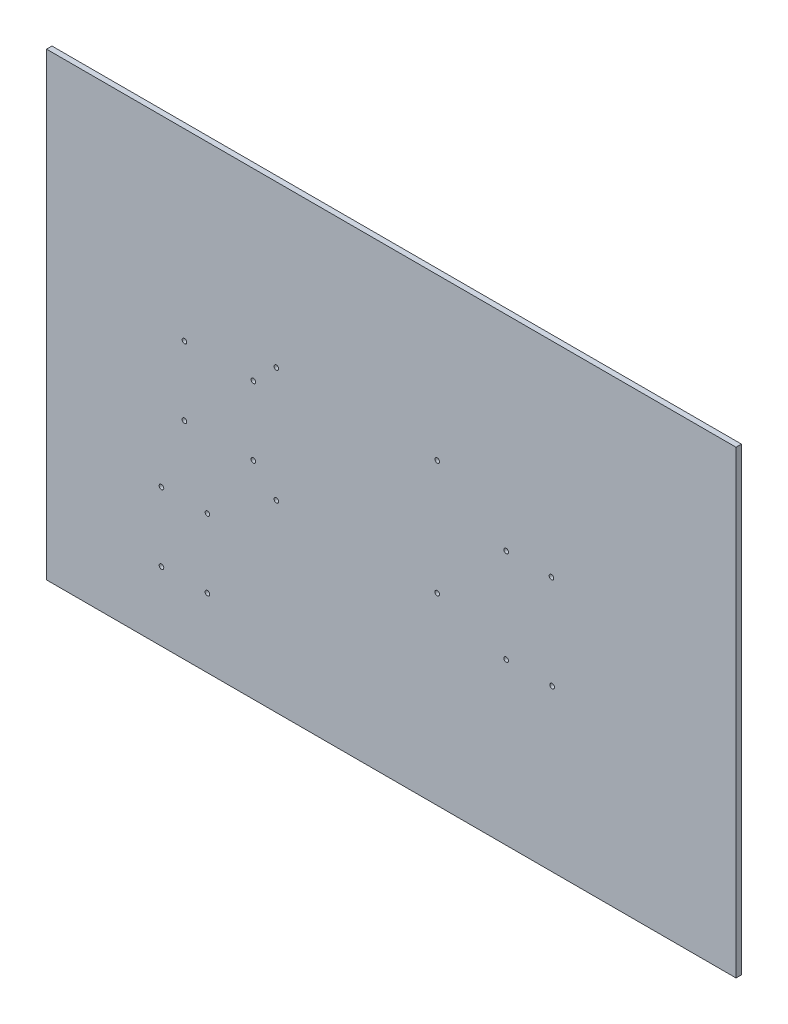
ISO-10303-21;
HEADER;
FILE_DESCRIPTION(('STEP AP214'),'2;1');
FILE_NAME('part.step','',(''),(''),'','','');
FILE_SCHEMA(('AUTOMOTIVE_DESIGN { 1 0 10303 214 1 1 1 1 }'));
ENDSEC;
DATA;
#1=APPLICATION_CONTEXT('core data for automotive mechanical design processes');
#2=APPLICATION_PROTOCOL_DEFINITION('international standard','automotive_design',2000,#1);
#3=PRODUCT_CONTEXT('',#1,'mechanical');
#4=PRODUCT('Part','Part','',(#3));
#5=PRODUCT_RELATED_PRODUCT_CATEGORY('part','',(#4));
#6=PRODUCT_DEFINITION_FORMATION('','',#4);
#7=PRODUCT_DEFINITION_CONTEXT('part definition',#1,'design');
#8=PRODUCT_DEFINITION('design','',#6,#7);
#9=PRODUCT_DEFINITION_SHAPE('','',#8);
#10=(LENGTH_UNIT() NAMED_UNIT(*) SI_UNIT(.MILLI.,.METRE.));
#11=(NAMED_UNIT(*) PLANE_ANGLE_UNIT() SI_UNIT($,.RADIAN.));
#12=(NAMED_UNIT(*) SI_UNIT($,.STERADIAN.) SOLID_ANGLE_UNIT());
#13=UNCERTAINTY_MEASURE_WITH_UNIT(LENGTH_MEASURE(1.E-05),#10,'distance_accuracy_value','');
#14=(GEOMETRIC_REPRESENTATION_CONTEXT(3) GLOBAL_UNCERTAINTY_ASSIGNED_CONTEXT((#13)) GLOBAL_UNIT_ASSIGNED_CONTEXT((#10,
#11,#12)) REPRESENTATION_CONTEXT('',''));
#15=CARTESIAN_POINT('',(0.,0.,0.));
#16=DIRECTION('',(0.,0.,1.));
#17=DIRECTION('',(1.,0.,0.));
#18=AXIS2_PLACEMENT_3D('',#15,#16,#17);
#19=CARTESIAN_POINT('',(0.,0.,6.));
#20=DIRECTION('',(0.,0.,-1.));
#21=DIRECTION('',(-1.,0.,0.));
#22=AXIS2_PLACEMENT_3D('',#19,#20,#21);
#23=PLANE('',#22);
#24=DIRECTION('',(0.,1.,0.));
#25=VECTOR('',#24,1.);
#26=CARTESIAN_POINT('',(381.,-254.,6.));
#27=LINE('',#26,#25);
#28=CARTESIAN_POINT('',(381.,-254.,6.));
#29=VERTEX_POINT('',#28);
#30=CARTESIAN_POINT('',(381.,254.,6.));
#31=VERTEX_POINT('',#30);
#32=EDGE_CURVE('E91',#29,#31,#27,.T.);
#33=ORIENTED_EDGE('',*,*,#32,.T.);
#34=DIRECTION('',(-1.,0.,0.));
#35=VECTOR('',#34,1.);
#36=CARTESIAN_POINT('',(-381.,254.,6.));
#37=LINE('',#36,#35);
#38=CARTESIAN_POINT('',(-381.,254.,6.));
#39=VERTEX_POINT('',#38);
#40=EDGE_CURVE('E86',#31,#39,#37,.T.);
#41=ORIENTED_EDGE('',*,*,#40,.T.);
#42=DIRECTION('',(0.,-1.,0.));
#43=VECTOR('',#42,1.);
#44=CARTESIAN_POINT('',(-381.,-254.,6.));
#45=LINE('',#44,#43);
#46=CARTESIAN_POINT('',(-381.,-254.,6.));
#47=VERTEX_POINT('',#46);
#48=EDGE_CURVE('E89',#39,#47,#45,.T.);
#49=ORIENTED_EDGE('',*,*,#48,.T.);
#50=DIRECTION('',(1.,0.,0.));
#51=VECTOR('',#50,1.);
#52=CARTESIAN_POINT('',(-381.,-254.,6.));
#53=LINE('',#52,#51);
#54=EDGE_CURVE('E56',#47,#29,#53,.T.);
#55=ORIENTED_EDGE('',*,*,#54,.T.);
#56=EDGE_LOOP('',(#33,#41,#49,#55));
#57=FACE_BOUND('',#56,.T.);
#58=CARTESIAN_POINT('',(-228.6,50.8,6.));
#59=DIRECTION('',(0.,0.,1.));
#60=DIRECTION('',(1.,0.,0.));
#61=AXIS2_PLACEMENT_3D('',#58,#59,#60);
#62=CIRCLE('',#61,2.55500000000001);
#63=CARTESIAN_POINT('',(-226.045,50.8,6.));
#64=VERTEX_POINT('',#63);
#65=EDGE_CURVE('E106',#64,#64,#62,.T.);
#66=ORIENTED_EDGE('',*,*,#65,.F.);
#67=EDGE_LOOP('',(#66));
#68=FACE_BOUND('',#67,.T.);
#69=CARTESIAN_POINT('',(-228.6,-25.4,6.));
#70=DIRECTION('',(0.,0.,1.));
#71=DIRECTION('',(1.,0.,0.));
#72=AXIS2_PLACEMENT_3D('',#69,#70,#71);
#73=CIRCLE('',#72,2.55500000000001);
#74=CARTESIAN_POINT('',(-226.045,-25.4,6.));
#75=VERTEX_POINT('',#74);
#76=EDGE_CURVE('E121',#75,#75,#73,.T.);
#77=ORIENTED_EDGE('',*,*,#76,.F.);
#78=EDGE_LOOP('',(#77));
#79=FACE_BOUND('',#78,.T.);
#80=CARTESIAN_POINT('',(-152.4,50.8,6.));
#81=DIRECTION('',(0.,0.,1.));
#82=DIRECTION('',(1.,0.,0.));
#83=AXIS2_PLACEMENT_3D('',#80,#81,#82);
#84=CIRCLE('',#83,2.55500000000001);
#85=CARTESIAN_POINT('',(-149.845,50.8,6.));
#86=VERTEX_POINT('',#85);
#87=EDGE_CURVE('E127',#86,#86,#84,.T.);
#88=ORIENTED_EDGE('',*,*,#87,.F.);
#89=EDGE_LOOP('',(#88));
#90=FACE_BOUND('',#89,.T.);
#91=CARTESIAN_POINT('',(-152.4,-25.3999999999999,6.));
#92=DIRECTION('',(0.,0.,1.));
#93=DIRECTION('',(1.,0.,0.));
#94=AXIS2_PLACEMENT_3D('',#91,#92,#93);
#95=CIRCLE('',#94,2.55500000000001);
#96=CARTESIAN_POINT('',(-149.845,-25.3999999999999,6.));
#97=VERTEX_POINT('',#96);
#98=EDGE_CURVE('E133',#97,#97,#95,.T.);
#99=ORIENTED_EDGE('',*,*,#98,.F.);
#100=EDGE_LOOP('',(#99));
#101=FACE_BOUND('',#100,.T.);
#102=CARTESIAN_POINT('',(-127.,76.2,6.));
#103=DIRECTION('',(0.,0.,1.));
#104=DIRECTION('',(1.,0.,0.));
#105=AXIS2_PLACEMENT_3D('',#102,#103,#104);
#106=CIRCLE('',#105,2.555);
#107=CARTESIAN_POINT('',(-124.445,76.2,6.));
#108=VERTEX_POINT('',#107);
#109=EDGE_CURVE('E139',#108,#108,#106,.T.);
#110=ORIENTED_EDGE('',*,*,#109,.F.);
#111=EDGE_LOOP('',(#110));
#112=FACE_BOUND('',#111,.T.);
#113=CARTESIAN_POINT('',(-127.,-50.8,6.));
#114=DIRECTION('',(0.,0.,1.));
#115=DIRECTION('',(1.,0.,0.));
#116=AXIS2_PLACEMENT_3D('',#113,#114,#115);
#117=CIRCLE('',#116,2.555);
#118=CARTESIAN_POINT('',(-124.445,-50.8,6.));
#119=VERTEX_POINT('',#118);
#120=EDGE_CURVE('E145',#119,#119,#117,.T.);
#121=ORIENTED_EDGE('',*,*,#120,.F.);
#122=EDGE_LOOP('',(#121));
#123=FACE_BOUND('',#122,.T.);
#124=CARTESIAN_POINT('',(50.8000000000002,76.2,6.));
#125=DIRECTION('',(0.,0.,1.));
#126=DIRECTION('',(1.,0.,0.));
#127=AXIS2_PLACEMENT_3D('',#124,#125,#126);
#128=CIRCLE('',#127,2.55500000000001);
#129=CARTESIAN_POINT('',(53.3550000000003,76.2,6.));
#130=VERTEX_POINT('',#129);
#131=EDGE_CURVE('E151',#130,#130,#128,.T.);
#132=ORIENTED_EDGE('',*,*,#131,.F.);
#133=EDGE_LOOP('',(#132));
#134=FACE_BOUND('',#133,.T.);
#135=CARTESIAN_POINT('',(50.8000000000002,-50.8,6.));
#136=DIRECTION('',(0.,0.,1.));
#137=DIRECTION('',(1.,0.,0.));
#138=AXIS2_PLACEMENT_3D('',#135,#136,#137);
#139=CIRCLE('',#138,2.555);
#140=CARTESIAN_POINT('',(53.3550000000002,-50.8,6.));
#141=VERTEX_POINT('',#140);
#142=EDGE_CURVE('E157',#141,#141,#139,.T.);
#143=ORIENTED_EDGE('',*,*,#142,.F.);
#144=EDGE_LOOP('',(#143));
#145=FACE_BOUND('',#144,.T.);
#146=CARTESIAN_POINT('',(-203.2,-177.8,6.));
#147=DIRECTION('',(0.,0.,1.));
#148=DIRECTION('',(1.,0.,0.));
#149=AXIS2_PLACEMENT_3D('',#146,#147,#148);
#150=CIRCLE('',#149,2.55500000000001);
#151=CARTESIAN_POINT('',(-200.645,-177.8,6.));
#152=VERTEX_POINT('',#151);
#153=EDGE_CURVE('E163',#152,#152,#150,.T.);
#154=ORIENTED_EDGE('',*,*,#153,.F.);
#155=EDGE_LOOP('',(#154));
#156=FACE_BOUND('',#155,.T.);
#157=CARTESIAN_POINT('',(-254.,-101.6,6.));
#158=DIRECTION('',(0.,0.,1.));
#159=DIRECTION('',(1.,0.,0.));
#160=AXIS2_PLACEMENT_3D('',#157,#158,#159);
#161=CIRCLE('',#160,2.55499999999998);
#162=CARTESIAN_POINT('',(-251.445,-101.6,6.));
#163=VERTEX_POINT('',#162);
#164=EDGE_CURVE('E169',#163,#163,#161,.T.);
#165=ORIENTED_EDGE('',*,*,#164,.F.);
#166=EDGE_LOOP('',(#165));
#167=FACE_BOUND('',#166,.T.);
#168=CARTESIAN_POINT('',(-254.,-177.8,6.));
#169=DIRECTION('',(0.,0.,1.));
#170=DIRECTION('',(1.,0.,0.));
#171=AXIS2_PLACEMENT_3D('',#168,#169,#170);
#172=CIRCLE('',#171,2.55499999999999);
#173=CARTESIAN_POINT('',(-251.445,-177.8,6.));
#174=VERTEX_POINT('',#173);
#175=EDGE_CURVE('E175',#174,#174,#172,.T.);
#176=ORIENTED_EDGE('',*,*,#175,.F.);
#177=EDGE_LOOP('',(#176));
#178=FACE_BOUND('',#177,.T.);
#179=CARTESIAN_POINT('',(-203.2,-101.6,6.));
#180=DIRECTION('',(0.,0.,1.));
#181=DIRECTION('',(1.,0.,0.));
#182=AXIS2_PLACEMENT_3D('',#179,#180,#181);
#183=CIRCLE('',#182,2.55500000000001);
#184=CARTESIAN_POINT('',(-200.645,-101.6,6.));
#185=VERTEX_POINT('',#184);
#186=EDGE_CURVE('E181',#185,#185,#183,.T.);
#187=ORIENTED_EDGE('',*,*,#186,.F.);
#188=EDGE_LOOP('',(#187));
#189=FACE_BOUND('',#188,.T.);
#190=CARTESIAN_POINT('',(127.,27.7,6.));
#191=DIRECTION('',(0.,0.,1.));
#192=DIRECTION('',(1.,0.,0.));
#193=AXIS2_PLACEMENT_3D('',#190,#191,#192);
#194=CIRCLE('',#193,2.55500000000001);
#195=CARTESIAN_POINT('',(129.555,27.7,6.));
#196=VERTEX_POINT('',#195);
#197=EDGE_CURVE('E187',#196,#196,#194,.T.);
#198=ORIENTED_EDGE('',*,*,#197,.F.);
#199=EDGE_LOOP('',(#198));
#200=FACE_BOUND('',#199,.T.);
#201=CARTESIAN_POINT('',(177.,27.6969200698462,6.));
#202=DIRECTION('',(0.,0.,1.));
#203=DIRECTION('',(1.,0.,0.));
#204=AXIS2_PLACEMENT_3D('',#201,#202,#203);
#205=CIRCLE('',#204,2.55500000000001);
#206=CARTESIAN_POINT('',(179.555,27.6969200698462,6.));
#207=VERTEX_POINT('',#206);
#208=EDGE_CURVE('E193',#207,#207,#205,.T.);
#209=ORIENTED_EDGE('',*,*,#208,.F.);
#210=EDGE_LOOP('',(#209));
#211=FACE_BOUND('',#210,.T.);
#212=CARTESIAN_POINT('',(177.8,-76.2,6.));
#213=DIRECTION('',(0.,0.,1.));
#214=DIRECTION('',(1.,0.,0.));
#215=AXIS2_PLACEMENT_3D('',#212,#213,#214);
#216=CIRCLE('',#215,2.55500000000001);
#217=CARTESIAN_POINT('',(180.355,-76.2,6.));
#218=VERTEX_POINT('',#217);
#219=EDGE_CURVE('E199',#218,#218,#216,.T.);
#220=ORIENTED_EDGE('',*,*,#219,.F.);
#221=EDGE_LOOP('',(#220));
#222=FACE_BOUND('',#221,.T.);
#223=CARTESIAN_POINT('',(127.,-76.2,6.));
#224=DIRECTION('',(0.,0.,1.));
#225=DIRECTION('',(1.,0.,0.));
#226=AXIS2_PLACEMENT_3D('',#223,#224,#225);
#227=CIRCLE('',#226,2.55500000000001);
#228=CARTESIAN_POINT('',(129.555,-76.2,6.));
#229=VERTEX_POINT('',#228);
#230=EDGE_CURVE('E205',#229,#229,#227,.T.);
#231=ORIENTED_EDGE('',*,*,#230,.F.);
#232=EDGE_LOOP('',(#231));
#233=FACE_BOUND('',#232,.T.);
#234=ADVANCED_FACE('F39',(#57,#68,#79,#90,#101,#112,#123,#134,#145,#156,#167,#178,#189,#200,
#211,#222,#233),#23,.F.);
#235=CARTESIAN_POINT('',(0.,0.,0.));
#236=DIRECTION('',(0.,0.,-1.));
#237=DIRECTION('',(-1.,0.,0.));
#238=AXIS2_PLACEMENT_3D('',#235,#236,#237);
#239=PLANE('',#238);
#240=CARTESIAN_POINT('',(177.8,-76.2,0.));
#241=DIRECTION('',(0.,0.,1.));
#242=DIRECTION('',(1.,0.,0.));
#243=AXIS2_PLACEMENT_3D('',#240,#241,#242);
#244=CIRCLE('',#243,2.55500000000001);
#245=CARTESIAN_POINT('',(180.355,-76.2,0.));
#246=VERTEX_POINT('',#245);
#247=EDGE_CURVE('E202',#246,#246,#244,.T.);
#248=ORIENTED_EDGE('',*,*,#247,.T.);
#249=EDGE_LOOP('',(#248));
#250=FACE_BOUND('',#249,.T.);
#251=CARTESIAN_POINT('',(127.,27.7,0.));
#252=DIRECTION('',(0.,0.,1.));
#253=DIRECTION('',(1.,0.,0.));
#254=AXIS2_PLACEMENT_3D('',#251,#252,#253);
#255=CIRCLE('',#254,2.55500000000001);
#256=CARTESIAN_POINT('',(129.555,27.7,0.));
#257=VERTEX_POINT('',#256);
#258=EDGE_CURVE('E190',#257,#257,#255,.T.);
#259=ORIENTED_EDGE('',*,*,#258,.T.);
#260=EDGE_LOOP('',(#259));
#261=FACE_BOUND('',#260,.T.);
#262=CARTESIAN_POINT('',(-254.,-177.8,0.));
#263=DIRECTION('',(0.,0.,1.));
#264=DIRECTION('',(1.,0.,0.));
#265=AXIS2_PLACEMENT_3D('',#262,#263,#264);
#266=CIRCLE('',#265,2.55499999999999);
#267=CARTESIAN_POINT('',(-251.445,-177.8,0.));
#268=VERTEX_POINT('',#267);
#269=EDGE_CURVE('E178',#268,#268,#266,.T.);
#270=ORIENTED_EDGE('',*,*,#269,.T.);
#271=EDGE_LOOP('',(#270));
#272=FACE_BOUND('',#271,.T.);
#273=CARTESIAN_POINT('',(-203.2,-177.8,0.));
#274=DIRECTION('',(0.,0.,1.));
#275=DIRECTION('',(1.,0.,0.));
#276=AXIS2_PLACEMENT_3D('',#273,#274,#275);
#277=CIRCLE('',#276,2.55500000000001);
#278=CARTESIAN_POINT('',(-200.645,-177.8,0.));
#279=VERTEX_POINT('',#278);
#280=EDGE_CURVE('E166',#279,#279,#277,.T.);
#281=ORIENTED_EDGE('',*,*,#280,.T.);
#282=EDGE_LOOP('',(#281));
#283=FACE_BOUND('',#282,.T.);
#284=CARTESIAN_POINT('',(50.8000000000002,76.2,0.));
#285=DIRECTION('',(0.,0.,1.));
#286=DIRECTION('',(1.,0.,0.));
#287=AXIS2_PLACEMENT_3D('',#284,#285,#286);
#288=CIRCLE('',#287,2.55500000000001);
#289=CARTESIAN_POINT('',(53.3550000000003,76.2,0.));
#290=VERTEX_POINT('',#289);
#291=EDGE_CURVE('E154',#290,#290,#288,.T.);
#292=ORIENTED_EDGE('',*,*,#291,.T.);
#293=EDGE_LOOP('',(#292));
#294=FACE_BOUND('',#293,.T.);
#295=CARTESIAN_POINT('',(-127.,76.2,0.));
#296=DIRECTION('',(0.,0.,1.));
#297=DIRECTION('',(1.,0.,0.));
#298=AXIS2_PLACEMENT_3D('',#295,#296,#297);
#299=CIRCLE('',#298,2.555);
#300=CARTESIAN_POINT('',(-124.445,76.2,0.));
#301=VERTEX_POINT('',#300);
#302=EDGE_CURVE('E142',#301,#301,#299,.T.);
#303=ORIENTED_EDGE('',*,*,#302,.T.);
#304=EDGE_LOOP('',(#303));
#305=FACE_BOUND('',#304,.T.);
#306=CARTESIAN_POINT('',(-152.4,50.8,0.));
#307=DIRECTION('',(0.,0.,1.));
#308=DIRECTION('',(1.,0.,0.));
#309=AXIS2_PLACEMENT_3D('',#306,#307,#308);
#310=CIRCLE('',#309,2.55500000000001);
#311=CARTESIAN_POINT('',(-149.845,50.8,0.));
#312=VERTEX_POINT('',#311);
#313=EDGE_CURVE('E130',#312,#312,#310,.T.);
#314=ORIENTED_EDGE('',*,*,#313,.T.);
#315=EDGE_LOOP('',(#314));
#316=FACE_BOUND('',#315,.T.);
#317=CARTESIAN_POINT('',(-228.6,50.8,0.));
#318=DIRECTION('',(0.,0.,1.));
#319=DIRECTION('',(1.,0.,0.));
#320=AXIS2_PLACEMENT_3D('',#317,#318,#319);
#321=CIRCLE('',#320,2.55500000000001);
#322=CARTESIAN_POINT('',(-226.045,50.8,0.));
#323=VERTEX_POINT('',#322);
#324=EDGE_CURVE('E118',#323,#323,#321,.T.);
#325=ORIENTED_EDGE('',*,*,#324,.T.);
#326=EDGE_LOOP('',(#325));
#327=FACE_BOUND('',#326,.T.);
#328=DIRECTION('',(0.,1.,0.));
#329=VECTOR('',#328,1.);
#330=CARTESIAN_POINT('',(381.,-254.,0.));
#331=LINE('',#330,#329);
#332=CARTESIAN_POINT('',(381.,-254.,0.));
#333=VERTEX_POINT('',#332);
#334=CARTESIAN_POINT('',(381.,254.,0.));
#335=VERTEX_POINT('',#334);
#336=EDGE_CURVE('E103',#333,#335,#331,.T.);
#337=ORIENTED_EDGE('',*,*,#336,.F.);
#338=DIRECTION('',(1.,0.,0.));
#339=VECTOR('',#338,1.);
#340=CARTESIAN_POINT('',(-381.,-254.,0.));
#341=LINE('',#340,#339);
#342=CARTESIAN_POINT('',(-381.,-254.,0.));
#343=VERTEX_POINT('',#342);
#344=EDGE_CURVE('E79',#343,#333,#341,.T.);
#345=ORIENTED_EDGE('',*,*,#344,.F.);
#346=DIRECTION('',(0.,-1.,0.));
#347=VECTOR('',#346,1.);
#348=CARTESIAN_POINT('',(-381.,-254.,0.));
#349=LINE('',#348,#347);
#350=CARTESIAN_POINT('',(-381.,254.,0.));
#351=VERTEX_POINT('',#350);
#352=EDGE_CURVE('E73',#351,#343,#349,.T.);
#353=ORIENTED_EDGE('',*,*,#352,.F.);
#354=DIRECTION('',(-1.,0.,0.));
#355=VECTOR('',#354,1.);
#356=CARTESIAN_POINT('',(-381.,254.,0.));
#357=LINE('',#356,#355);
#358=EDGE_CURVE('E95',#335,#351,#357,.T.);
#359=ORIENTED_EDGE('',*,*,#358,.F.);
#360=EDGE_LOOP('',(#337,#345,#353,#359));
#361=FACE_BOUND('',#360,.T.);
#362=CARTESIAN_POINT('',(-228.6,-25.4,0.));
#363=DIRECTION('',(0.,0.,1.));
#364=DIRECTION('',(1.,0.,0.));
#365=AXIS2_PLACEMENT_3D('',#362,#363,#364);
#366=CIRCLE('',#365,2.55500000000001);
#367=CARTESIAN_POINT('',(-226.045,-25.4,0.));
#368=VERTEX_POINT('',#367);
#369=EDGE_CURVE('E124',#368,#368,#366,.T.);
#370=ORIENTED_EDGE('',*,*,#369,.T.);
#371=EDGE_LOOP('',(#370));
#372=FACE_BOUND('',#371,.T.);
#373=CARTESIAN_POINT('',(-152.4,-25.3999999999999,0.));
#374=DIRECTION('',(0.,0.,1.));
#375=DIRECTION('',(1.,0.,0.));
#376=AXIS2_PLACEMENT_3D('',#373,#374,#375);
#377=CIRCLE('',#376,2.55500000000001);
#378=CARTESIAN_POINT('',(-149.845,-25.3999999999999,0.));
#379=VERTEX_POINT('',#378);
#380=EDGE_CURVE('E136',#379,#379,#377,.T.);
#381=ORIENTED_EDGE('',*,*,#380,.T.);
#382=EDGE_LOOP('',(#381));
#383=FACE_BOUND('',#382,.T.);
#384=CARTESIAN_POINT('',(-127.,-50.8,0.));
#385=DIRECTION('',(0.,0.,1.));
#386=DIRECTION('',(1.,0.,0.));
#387=AXIS2_PLACEMENT_3D('',#384,#385,#386);
#388=CIRCLE('',#387,2.555);
#389=CARTESIAN_POINT('',(-124.445,-50.8,0.));
#390=VERTEX_POINT('',#389);
#391=EDGE_CURVE('E148',#390,#390,#388,.T.);
#392=ORIENTED_EDGE('',*,*,#391,.T.);
#393=EDGE_LOOP('',(#392));
#394=FACE_BOUND('',#393,.T.);
#395=CARTESIAN_POINT('',(50.8000000000002,-50.8,0.));
#396=DIRECTION('',(0.,0.,1.));
#397=DIRECTION('',(1.,0.,0.));
#398=AXIS2_PLACEMENT_3D('',#395,#396,#397);
#399=CIRCLE('',#398,2.555);
#400=CARTESIAN_POINT('',(53.3550000000002,-50.8,0.));
#401=VERTEX_POINT('',#400);
#402=EDGE_CURVE('E160',#401,#401,#399,.T.);
#403=ORIENTED_EDGE('',*,*,#402,.T.);
#404=EDGE_LOOP('',(#403));
#405=FACE_BOUND('',#404,.T.);
#406=CARTESIAN_POINT('',(-254.,-101.6,0.));
#407=DIRECTION('',(0.,0.,1.));
#408=DIRECTION('',(1.,0.,0.));
#409=AXIS2_PLACEMENT_3D('',#406,#407,#408);
#410=CIRCLE('',#409,2.55499999999998);
#411=CARTESIAN_POINT('',(-251.445,-101.6,0.));
#412=VERTEX_POINT('',#411);
#413=EDGE_CURVE('E172',#412,#412,#410,.T.);
#414=ORIENTED_EDGE('',*,*,#413,.T.);
#415=EDGE_LOOP('',(#414));
#416=FACE_BOUND('',#415,.T.);
#417=CARTESIAN_POINT('',(-203.2,-101.6,0.));
#418=DIRECTION('',(0.,0.,1.));
#419=DIRECTION('',(1.,0.,0.));
#420=AXIS2_PLACEMENT_3D('',#417,#418,#419);
#421=CIRCLE('',#420,2.55500000000001);
#422=CARTESIAN_POINT('',(-200.645,-101.6,0.));
#423=VERTEX_POINT('',#422);
#424=EDGE_CURVE('E184',#423,#423,#421,.T.);
#425=ORIENTED_EDGE('',*,*,#424,.T.);
#426=EDGE_LOOP('',(#425));
#427=FACE_BOUND('',#426,.T.);
#428=CARTESIAN_POINT('',(177.,27.6969200698462,0.));
#429=DIRECTION('',(0.,0.,1.));
#430=DIRECTION('',(1.,0.,0.));
#431=AXIS2_PLACEMENT_3D('',#428,#429,#430);
#432=CIRCLE('',#431,2.55500000000001);
#433=CARTESIAN_POINT('',(179.555,27.6969200698462,0.));
#434=VERTEX_POINT('',#433);
#435=EDGE_CURVE('E196',#434,#434,#432,.T.);
#436=ORIENTED_EDGE('',*,*,#435,.T.);
#437=EDGE_LOOP('',(#436));
#438=FACE_BOUND('',#437,.T.);
#439=CARTESIAN_POINT('',(127.,-76.2,0.));
#440=DIRECTION('',(0.,0.,1.));
#441=DIRECTION('',(1.,0.,0.));
#442=AXIS2_PLACEMENT_3D('',#439,#440,#441);
#443=CIRCLE('',#442,2.55500000000001);
#444=CARTESIAN_POINT('',(129.555,-76.2,0.));
#445=VERTEX_POINT('',#444);
#446=EDGE_CURVE('E208',#445,#445,#443,.T.);
#447=ORIENTED_EDGE('',*,*,#446,.T.);
#448=EDGE_LOOP('',(#447));
#449=FACE_BOUND('',#448,.T.);
#450=ADVANCED_FACE('F114',(#250,#261,#272,#283,#294,#305,#316,#327,#361,#372,#383,#394,#405,
#416,#427,#438,#449),#239,.T.);
#451=CARTESIAN_POINT('',(381.,-254.,6.));
#452=DIRECTION('',(-1.,0.,0.));
#453=DIRECTION('',(0.,0.,1.));
#454=AXIS2_PLACEMENT_3D('',#451,#452,#453);
#455=PLANE('',#454);
#456=ORIENTED_EDGE('',*,*,#336,.T.);
#457=DIRECTION('',(0.,0.,-1.));
#458=VECTOR('',#457,1.);
#459=CARTESIAN_POINT('',(381.,254.,6.));
#460=LINE('',#459,#458);
#461=EDGE_CURVE('E11',#31,#335,#460,.T.);
#462=ORIENTED_EDGE('',*,*,#461,.F.);
#463=ORIENTED_EDGE('',*,*,#32,.F.);
#464=DIRECTION('',(0.,0.,-1.));
#465=VECTOR('',#464,1.);
#466=CARTESIAN_POINT('',(381.,-254.,6.));
#467=LINE('',#466,#465);
#468=EDGE_CURVE('E99',#29,#333,#467,.T.);
#469=ORIENTED_EDGE('',*,*,#468,.T.);
#470=EDGE_LOOP('',(#456,#462,#463,#469));
#471=FACE_BOUND('',#470,.T.);
#472=ADVANCED_FACE('F41',(#471),#455,.F.);
#473=CARTESIAN_POINT('',(-381.,254.,6.));
#474=DIRECTION('',(0.,-1.,0.));
#475=DIRECTION('',(0.,0.,-1.));
#476=AXIS2_PLACEMENT_3D('',#473,#474,#475);
#477=PLANE('',#476);
#478=ORIENTED_EDGE('',*,*,#358,.T.);
#479=DIRECTION('',(0.,0.,-1.));
#480=VECTOR('',#479,1.);
#481=CARTESIAN_POINT('',(-381.,254.,6.));
#482=LINE('',#481,#480);
#483=EDGE_CURVE('E48',#39,#351,#482,.T.);
#484=ORIENTED_EDGE('',*,*,#483,.F.);
#485=ORIENTED_EDGE('',*,*,#40,.F.);
#486=ORIENTED_EDGE('',*,*,#461,.T.);
#487=EDGE_LOOP('',(#478,#484,#485,#486));
#488=FACE_BOUND('',#487,.T.);
#489=ADVANCED_FACE('F94',(#488),#477,.F.);
#490=CARTESIAN_POINT('',(-381.,-254.,6.));
#491=DIRECTION('',(1.,0.,0.));
#492=DIRECTION('',(0.,0.,-1.));
#493=AXIS2_PLACEMENT_3D('',#490,#491,#492);
#494=PLANE('',#493);
#495=ORIENTED_EDGE('',*,*,#352,.T.);
#496=DIRECTION('',(0.,0.,-1.));
#497=VECTOR('',#496,1.);
#498=CARTESIAN_POINT('',(-381.,-254.,6.));
#499=LINE('',#498,#497);
#500=EDGE_CURVE('E96',#47,#343,#499,.T.);
#501=ORIENTED_EDGE('',*,*,#500,.F.);
#502=ORIENTED_EDGE('',*,*,#48,.F.);
#503=ORIENTED_EDGE('',*,*,#483,.T.);
#504=EDGE_LOOP('',(#495,#501,#502,#503));
#505=FACE_BOUND('',#504,.T.);
#506=ADVANCED_FACE('F97',(#505),#494,.F.);
#507=CARTESIAN_POINT('',(-381.,-254.,6.));
#508=DIRECTION('',(0.,1.,0.));
#509=DIRECTION('',(0.,0.,1.));
#510=AXIS2_PLACEMENT_3D('',#507,#508,#509);
#511=PLANE('',#510);
#512=ORIENTED_EDGE('',*,*,#344,.T.);
#513=ORIENTED_EDGE('',*,*,#468,.F.);
#514=ORIENTED_EDGE('',*,*,#54,.F.);
#515=ORIENTED_EDGE('',*,*,#500,.T.);
#516=EDGE_LOOP('',(#512,#513,#514,#515));
#517=FACE_BOUND('',#516,.T.);
#518=ADVANCED_FACE('F111',(#517),#511,.F.);
#519=CARTESIAN_POINT('',(-228.6,50.8,6.));
#520=DIRECTION('',(0.,0.,-1.));
#521=DIRECTION('',(-1.,0.,0.));
#522=AXIS2_PLACEMENT_3D('',#519,#520,#521);
#523=CYLINDRICAL_SURFACE('',#522,2.55500000000001);
#524=ORIENTED_EDGE('',*,*,#65,.T.);
#525=EDGE_LOOP('',(#524));
#526=FACE_BOUND('',#525,.T.);
#527=ORIENTED_EDGE('',*,*,#324,.F.);
#528=EDGE_LOOP('',(#527));
#529=FACE_BOUND('',#528,.T.);
#530=ADVANCED_FACE('F225',(#526,#529),#523,.F.);
#531=CARTESIAN_POINT('',(-228.6,-25.4,6.));
#532=DIRECTION('',(0.,0.,-1.));
#533=DIRECTION('',(-1.,0.,0.));
#534=AXIS2_PLACEMENT_3D('',#531,#532,#533);
#535=CYLINDRICAL_SURFACE('',#534,2.55500000000001);
#536=ORIENTED_EDGE('',*,*,#76,.T.);
#537=EDGE_LOOP('',(#536));
#538=FACE_BOUND('',#537,.T.);
#539=ORIENTED_EDGE('',*,*,#369,.F.);
#540=EDGE_LOOP('',(#539));
#541=FACE_BOUND('',#540,.T.);
#542=ADVANCED_FACE('F270',(#538,#541),#535,.F.);
#543=CARTESIAN_POINT('',(-152.4,50.8,6.));
#544=DIRECTION('',(0.,0.,-1.));
#545=DIRECTION('',(-1.,0.,0.));
#546=AXIS2_PLACEMENT_3D('',#543,#544,#545);
#547=CYLINDRICAL_SURFACE('',#546,2.55500000000001);
#548=ORIENTED_EDGE('',*,*,#87,.T.);
#549=EDGE_LOOP('',(#548));
#550=FACE_BOUND('',#549,.T.);
#551=ORIENTED_EDGE('',*,*,#313,.F.);
#552=EDGE_LOOP('',(#551));
#553=FACE_BOUND('',#552,.T.);
#554=ADVANCED_FACE('F278',(#550,#553),#547,.F.);
#555=CARTESIAN_POINT('',(-152.4,-25.3999999999999,6.));
#556=DIRECTION('',(0.,0.,-1.));
#557=DIRECTION('',(-1.,0.,0.));
#558=AXIS2_PLACEMENT_3D('',#555,#556,#557);
#559=CYLINDRICAL_SURFACE('',#558,2.55500000000001);
#560=ORIENTED_EDGE('',*,*,#98,.T.);
#561=EDGE_LOOP('',(#560));
#562=FACE_BOUND('',#561,.T.);
#563=ORIENTED_EDGE('',*,*,#380,.F.);
#564=EDGE_LOOP('',(#563));
#565=FACE_BOUND('',#564,.T.);
#566=ADVANCED_FACE('F286',(#562,#565),#559,.F.);
#567=CARTESIAN_POINT('',(-127.,76.2,6.));
#568=DIRECTION('',(0.,0.,-1.));
#569=DIRECTION('',(-1.,0.,0.));
#570=AXIS2_PLACEMENT_3D('',#567,#568,#569);
#571=CYLINDRICAL_SURFACE('',#570,2.555);
#572=ORIENTED_EDGE('',*,*,#109,.T.);
#573=EDGE_LOOP('',(#572));
#574=FACE_BOUND('',#573,.T.);
#575=ORIENTED_EDGE('',*,*,#302,.F.);
#576=EDGE_LOOP('',(#575));
#577=FACE_BOUND('',#576,.T.);
#578=ADVANCED_FACE('F295',(#574,#577),#571,.F.);
#579=CARTESIAN_POINT('',(-127.,-50.8,6.));
#580=DIRECTION('',(0.,0.,-1.));
#581=DIRECTION('',(-1.,0.,0.));
#582=AXIS2_PLACEMENT_3D('',#579,#580,#581);
#583=CYLINDRICAL_SURFACE('',#582,2.555);
#584=ORIENTED_EDGE('',*,*,#120,.T.);
#585=EDGE_LOOP('',(#584));
#586=FACE_BOUND('',#585,.T.);
#587=ORIENTED_EDGE('',*,*,#391,.F.);
#588=EDGE_LOOP('',(#587));
#589=FACE_BOUND('',#588,.T.);
#590=ADVANCED_FACE('F304',(#586,#589),#583,.F.);
#591=CARTESIAN_POINT('',(50.8000000000002,76.2,6.));
#592=DIRECTION('',(0.,0.,-1.));
#593=DIRECTION('',(-1.,0.,0.));
#594=AXIS2_PLACEMENT_3D('',#591,#592,#593);
#595=CYLINDRICAL_SURFACE('',#594,2.55500000000001);
#596=ORIENTED_EDGE('',*,*,#131,.T.);
#597=EDGE_LOOP('',(#596));
#598=FACE_BOUND('',#597,.T.);
#599=ORIENTED_EDGE('',*,*,#291,.F.);
#600=EDGE_LOOP('',(#599));
#601=FACE_BOUND('',#600,.T.);
#602=ADVANCED_FACE('F313',(#598,#601),#595,.F.);
#603=CARTESIAN_POINT('',(50.8000000000002,-50.8,6.));
#604=DIRECTION('',(0.,0.,-1.));
#605=DIRECTION('',(-1.,0.,0.));
#606=AXIS2_PLACEMENT_3D('',#603,#604,#605);
#607=CYLINDRICAL_SURFACE('',#606,2.555);
#608=ORIENTED_EDGE('',*,*,#142,.T.);
#609=EDGE_LOOP('',(#608));
#610=FACE_BOUND('',#609,.T.);
#611=ORIENTED_EDGE('',*,*,#402,.F.);
#612=EDGE_LOOP('',(#611));
#613=FACE_BOUND('',#612,.T.);
#614=ADVANCED_FACE('F322',(#610,#613),#607,.F.);
#615=CARTESIAN_POINT('',(-203.2,-177.8,6.));
#616=DIRECTION('',(0.,0.,-1.));
#617=DIRECTION('',(-1.,0.,0.));
#618=AXIS2_PLACEMENT_3D('',#615,#616,#617);
#619=CYLINDRICAL_SURFACE('',#618,2.55500000000001);
#620=ORIENTED_EDGE('',*,*,#153,.T.);
#621=EDGE_LOOP('',(#620));
#622=FACE_BOUND('',#621,.T.);
#623=ORIENTED_EDGE('',*,*,#280,.F.);
#624=EDGE_LOOP('',(#623));
#625=FACE_BOUND('',#624,.T.);
#626=ADVANCED_FACE('F331',(#622,#625),#619,.F.);
#627=CARTESIAN_POINT('',(-254.,-101.6,6.));
#628=DIRECTION('',(0.,0.,-1.));
#629=DIRECTION('',(-1.,0.,0.));
#630=AXIS2_PLACEMENT_3D('',#627,#628,#629);
#631=CYLINDRICAL_SURFACE('',#630,2.55499999999998);
#632=ORIENTED_EDGE('',*,*,#164,.T.);
#633=EDGE_LOOP('',(#632));
#634=FACE_BOUND('',#633,.T.);
#635=ORIENTED_EDGE('',*,*,#413,.F.);
#636=EDGE_LOOP('',(#635));
#637=FACE_BOUND('',#636,.T.);
#638=ADVANCED_FACE('F340',(#634,#637),#631,.F.);
#639=CARTESIAN_POINT('',(-254.,-177.8,6.));
#640=DIRECTION('',(0.,0.,-1.));
#641=DIRECTION('',(-1.,0.,0.));
#642=AXIS2_PLACEMENT_3D('',#639,#640,#641);
#643=CYLINDRICAL_SURFACE('',#642,2.55499999999999);
#644=ORIENTED_EDGE('',*,*,#175,.T.);
#645=EDGE_LOOP('',(#644));
#646=FACE_BOUND('',#645,.T.);
#647=ORIENTED_EDGE('',*,*,#269,.F.);
#648=EDGE_LOOP('',(#647));
#649=FACE_BOUND('',#648,.T.);
#650=ADVANCED_FACE('F349',(#646,#649),#643,.F.);
#651=CARTESIAN_POINT('',(-203.2,-101.6,6.));
#652=DIRECTION('',(0.,0.,-1.));
#653=DIRECTION('',(-1.,0.,0.));
#654=AXIS2_PLACEMENT_3D('',#651,#652,#653);
#655=CYLINDRICAL_SURFACE('',#654,2.55500000000001);
#656=ORIENTED_EDGE('',*,*,#186,.T.);
#657=EDGE_LOOP('',(#656));
#658=FACE_BOUND('',#657,.T.);
#659=ORIENTED_EDGE('',*,*,#424,.F.);
#660=EDGE_LOOP('',(#659));
#661=FACE_BOUND('',#660,.T.);
#662=ADVANCED_FACE('F358',(#658,#661),#655,.F.);
#663=CARTESIAN_POINT('',(127.,27.7,6.));
#664=DIRECTION('',(0.,0.,-1.));
#665=DIRECTION('',(-1.,0.,0.));
#666=AXIS2_PLACEMENT_3D('',#663,#664,#665);
#667=CYLINDRICAL_SURFACE('',#666,2.55500000000001);
#668=ORIENTED_EDGE('',*,*,#197,.T.);
#669=EDGE_LOOP('',(#668));
#670=FACE_BOUND('',#669,.T.);
#671=ORIENTED_EDGE('',*,*,#258,.F.);
#672=EDGE_LOOP('',(#671));
#673=FACE_BOUND('',#672,.T.);
#674=ADVANCED_FACE('F367',(#670,#673),#667,.F.);
#675=CARTESIAN_POINT('',(177.,27.6969200698462,6.));
#676=DIRECTION('',(0.,0.,-1.));
#677=DIRECTION('',(-1.,0.,0.));
#678=AXIS2_PLACEMENT_3D('',#675,#676,#677);
#679=CYLINDRICAL_SURFACE('',#678,2.55500000000001);
#680=ORIENTED_EDGE('',*,*,#208,.T.);
#681=EDGE_LOOP('',(#680));
#682=FACE_BOUND('',#681,.T.);
#683=ORIENTED_EDGE('',*,*,#435,.F.);
#684=EDGE_LOOP('',(#683));
#685=FACE_BOUND('',#684,.T.);
#686=ADVANCED_FACE('F376',(#682,#685),#679,.F.);
#687=CARTESIAN_POINT('',(177.8,-76.2,6.));
#688=DIRECTION('',(0.,0.,-1.));
#689=DIRECTION('',(-1.,0.,0.));
#690=AXIS2_PLACEMENT_3D('',#687,#688,#689);
#691=CYLINDRICAL_SURFACE('',#690,2.55500000000001);
#692=ORIENTED_EDGE('',*,*,#219,.T.);
#693=EDGE_LOOP('',(#692));
#694=FACE_BOUND('',#693,.T.);
#695=ORIENTED_EDGE('',*,*,#247,.F.);
#696=EDGE_LOOP('',(#695));
#697=FACE_BOUND('',#696,.T.);
#698=ADVANCED_FACE('F385',(#694,#697),#691,.F.);
#699=CARTESIAN_POINT('',(127.,-76.2,6.));
#700=DIRECTION('',(0.,0.,-1.));
#701=DIRECTION('',(-1.,0.,0.));
#702=AXIS2_PLACEMENT_3D('',#699,#700,#701);
#703=CYLINDRICAL_SURFACE('',#702,2.55500000000001);
#704=ORIENTED_EDGE('',*,*,#230,.T.);
#705=EDGE_LOOP('',(#704));
#706=FACE_BOUND('',#705,.T.);
#707=ORIENTED_EDGE('',*,*,#446,.F.);
#708=EDGE_LOOP('',(#707));
#709=FACE_BOUND('',#708,.T.);
#710=ADVANCED_FACE('F214',(#706,#709),#703,.F.);
#711=CLOSED_SHELL('',(#234,#450,#472,#489,#506,#518,#530,#542,#554,#566,#578,#590,#602,#614,
#626,#638,#650,#662,#674,#686,#698,#710));
#712=MANIFOLD_SOLID_BREP('B2',#711);
#713=ADVANCED_BREP_SHAPE_REPRESENTATION('',(#18,#712),#14);
#714=SHAPE_DEFINITION_REPRESENTATION(#9,#713);
ENDSEC;
END-ISO-10303-21;
